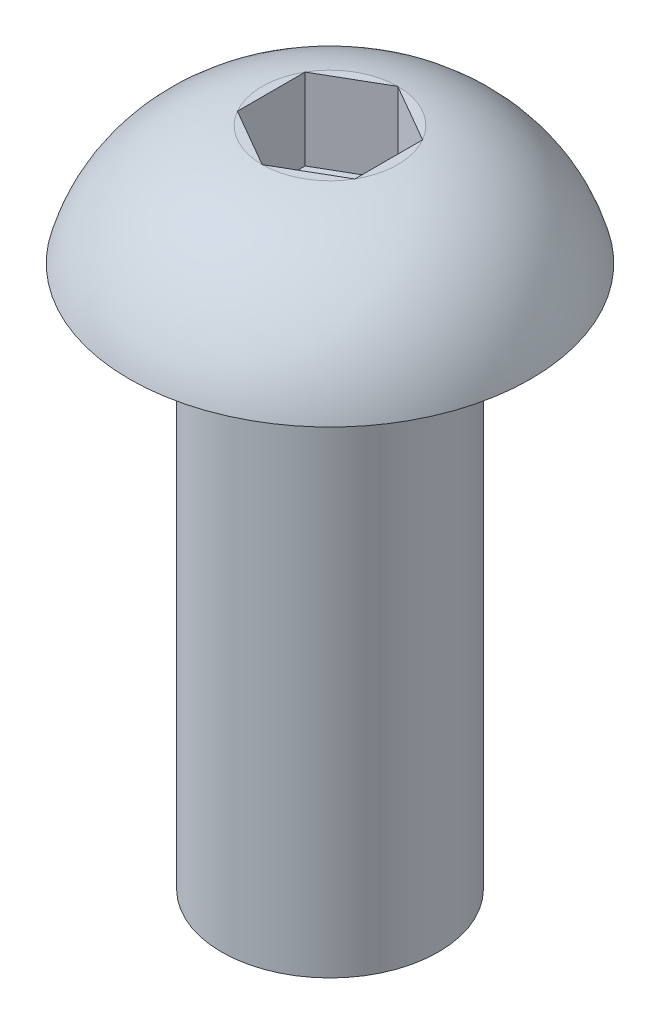
ISO-10303-21;
HEADER;
FILE_DESCRIPTION(('STEP AP214'),'2;1');
FILE_NAME('part.step','',(''),(''),'','','');
FILE_SCHEMA(('AUTOMOTIVE_DESIGN { 1 0 10303 214 1 1 1 1 }'));
ENDSEC;
DATA;
#1=APPLICATION_CONTEXT('core data for automotive mechanical design processes');
#2=APPLICATION_PROTOCOL_DEFINITION('international standard','automotive_design',2000,#1);
#3=PRODUCT_CONTEXT('',#1,'mechanical');
#4=PRODUCT('Part','Part','',(#3));
#5=PRODUCT_RELATED_PRODUCT_CATEGORY('part','',(#4));
#6=PRODUCT_DEFINITION_FORMATION('','',#4);
#7=PRODUCT_DEFINITION_CONTEXT('part definition',#1,'design');
#8=PRODUCT_DEFINITION('design','',#6,#7);
#9=PRODUCT_DEFINITION_SHAPE('','',#8);
#10=(LENGTH_UNIT() NAMED_UNIT(*) SI_UNIT(.MILLI.,.METRE.));
#11=(NAMED_UNIT(*) PLANE_ANGLE_UNIT() SI_UNIT($,.RADIAN.));
#12=(NAMED_UNIT(*) SI_UNIT($,.STERADIAN.) SOLID_ANGLE_UNIT());
#13=UNCERTAINTY_MEASURE_WITH_UNIT(LENGTH_MEASURE(1.E-05),#10,'distance_accuracy_value','');
#14=(GEOMETRIC_REPRESENTATION_CONTEXT(3) GLOBAL_UNCERTAINTY_ASSIGNED_CONTEXT((#13)) GLOBAL_UNIT_ASSIGNED_CONTEXT((#10,
#11,#12)) REPRESENTATION_CONTEXT('',''));
#15=CARTESIAN_POINT('',(0.,0.,0.));
#16=DIRECTION('',(0.,0.,1.));
#17=DIRECTION('',(1.,0.,0.));
#18=AXIS2_PLACEMENT_3D('',#15,#16,#17);
#19=CARTESIAN_POINT('',(0.,2.2,0.));
#20=DIRECTION('',(0.,1.,0.));
#21=DIRECTION('',(0.,0.,1.));
#22=AXIS2_PLACEMENT_3D('',#19,#20,#21);
#23=PLANE('',#22);
#24=DIRECTION('',(-0.866025403784439,0.,-0.5));
#25=VECTOR('',#24,1.);
#26=CARTESIAN_POINT('',(1.08253175473055,2.2,-0.625000000000001));
#27=LINE('',#26,#25);
#28=CARTESIAN_POINT('',(1.08253175473055,2.2,-0.625000000000001));
#29=VERTEX_POINT('',#28);
#30=CARTESIAN_POINT('',(0.,2.2,-1.25));
#31=VERTEX_POINT('',#30);
#32=EDGE_CURVE('E51',#29,#31,#27,.T.);
#33=ORIENTED_EDGE('',*,*,#32,.F.);
#34=CARTESIAN_POINT('',(0.,2.2,0.));
#35=DIRECTION('',(0.,1.,0.));
#36=DIRECTION('',(0.,0.,1.));
#37=AXIS2_PLACEMENT_3D('',#34,#35,#36);
#38=CIRCLE('',#37,1.25);
#39=EDGE_CURVE('E153',#29,#31,#38,.T.);
#40=ORIENTED_EDGE('',*,*,#39,.T.);
#41=EDGE_LOOP('',(#33,#40));
#42=FACE_BOUND('',#41,.T.);
#43=ADVANCED_FACE('F35',(#42),#23,.T.);
#44=DIRECTION('',(0.,0.,-1.));
#45=VECTOR('',#44,1.);
#46=CARTESIAN_POINT('',(1.08253175473055,2.2,0.625000000000001));
#47=LINE('',#46,#45);
#48=CARTESIAN_POINT('',(1.08253175473055,2.2,0.625000000000001));
#49=VERTEX_POINT('',#48);
#50=EDGE_CURVE('E134',#49,#29,#47,.T.);
#51=ORIENTED_EDGE('',*,*,#50,.F.);
#52=EDGE_CURVE('E148',#49,#29,#38,.T.);
#53=ORIENTED_EDGE('',*,*,#52,.T.);
#54=EDGE_LOOP('',(#51,#53));
#55=FACE_BOUND('',#54,.T.);
#56=ADVANCED_FACE('F176',(#55),#23,.T.);
#57=DIRECTION('',(0.866025403784439,0.,-0.5));
#58=VECTOR('',#57,1.);
#59=CARTESIAN_POINT('',(0.,2.2,1.25));
#60=LINE('',#59,#58);
#61=CARTESIAN_POINT('',(0.,2.2,1.25));
#62=VERTEX_POINT('',#61);
#63=EDGE_CURVE('E132',#62,#49,#60,.T.);
#64=ORIENTED_EDGE('',*,*,#63,.F.);
#65=EDGE_CURVE('E146',#62,#49,#38,.T.);
#66=ORIENTED_EDGE('',*,*,#65,.T.);
#67=EDGE_LOOP('',(#64,#66));
#68=FACE_BOUND('',#67,.T.);
#69=ADVANCED_FACE('F178',(#68),#23,.T.);
#70=DIRECTION('',(0.866025403784439,0.,0.5));
#71=VECTOR('',#70,1.);
#72=CARTESIAN_POINT('',(-1.08253175473055,2.2,0.625000000000001));
#73=LINE('',#72,#71);
#74=CARTESIAN_POINT('',(-1.08253175473055,2.2,0.625000000000001));
#75=VERTEX_POINT('',#74);
#76=EDGE_CURVE('E99',#75,#62,#73,.T.);
#77=ORIENTED_EDGE('',*,*,#76,.F.);
#78=EDGE_CURVE('E145',#75,#62,#38,.T.);
#79=ORIENTED_EDGE('',*,*,#78,.T.);
#80=EDGE_LOOP('',(#77,#79));
#81=FACE_BOUND('',#80,.T.);
#82=ADVANCED_FACE('F180',(#81),#23,.T.);
#83=DIRECTION('',(0.,0.,1.));
#84=VECTOR('',#83,1.);
#85=CARTESIAN_POINT('',(-1.08253175473055,2.2,-0.625));
#86=LINE('',#85,#84);
#87=CARTESIAN_POINT('',(-1.08253175473055,2.2,-0.625));
#88=VERTEX_POINT('',#87);
#89=EDGE_CURVE('E128',#88,#75,#86,.T.);
#90=ORIENTED_EDGE('',*,*,#89,.F.);
#91=EDGE_CURVE('E155',#88,#75,#38,.T.);
#92=ORIENTED_EDGE('',*,*,#91,.T.);
#93=EDGE_LOOP('',(#90,#92));
#94=FACE_BOUND('',#93,.T.);
#95=ADVANCED_FACE('F186',(#94),#23,.T.);
#96=CARTESIAN_POINT('',(0.,0.,0.));
#97=DIRECTION('',(0.,1.,0.));
#98=DIRECTION('',(0.,0.,1.));
#99=AXIS2_PLACEMENT_3D('',#96,#97,#98);
#100=PLANE('',#99);
#101=CARTESIAN_POINT('',(0.,0.,0.));
#102=DIRECTION('',(0.,-1.,0.));
#103=DIRECTION('',(0.,0.,-1.));
#104=AXIS2_PLACEMENT_3D('',#101,#102,#103);
#105=CIRCLE('',#104,2.);
#106=CARTESIAN_POINT('',(0.,0.,-2.));
#107=VERTEX_POINT('',#106);
#108=EDGE_CURVE('E11',#107,#107,#105,.T.);
#109=ORIENTED_EDGE('',*,*,#108,.F.);
#110=EDGE_LOOP('',(#109));
#111=FACE_BOUND('',#110,.T.);
#112=CARTESIAN_POINT('',(0.,0.,0.));
#113=DIRECTION('',(0.,1.,0.));
#114=DIRECTION('',(0.,0.,1.));
#115=AXIS2_PLACEMENT_3D('',#112,#113,#114);
#116=CIRCLE('',#115,3.7);
#117=CARTESIAN_POINT('',(0.,0.,3.7));
#118=VERTEX_POINT('',#117);
#119=EDGE_CURVE('E39',#118,#118,#116,.T.);
#120=ORIENTED_EDGE('',*,*,#119,.F.);
#121=EDGE_LOOP('',(#120));
#122=FACE_BOUND('',#121,.T.);
#123=ADVANCED_FACE('F37',(#111,#122),#100,.F.);
#124=CARTESIAN_POINT('',(0.,-0.765971962852529,0.));
#125=DIRECTION('',(0.,1.,0.));
#126=DIRECTION('',(0.,0.,1.));
#127=AXIS2_PLACEMENT_3D('',#124,#125,#126);
#128=DEGENERATE_TOROIDAL_SURFACE('',#127,0.799433339479361,3.,.T.);
#129=ORIENTED_EDGE('',*,*,#65,.F.);
#130=ORIENTED_EDGE('',*,*,#78,.F.);
#131=ORIENTED_EDGE('',*,*,#91,.F.);
#132=EDGE_CURVE('E159',#31,#88,#38,.T.);
#133=ORIENTED_EDGE('',*,*,#132,.F.);
#134=ORIENTED_EDGE('',*,*,#39,.F.);
#135=ORIENTED_EDGE('',*,*,#52,.F.);
#136=EDGE_LOOP('',(#129,#130,#131,#133,#134,#135));
#137=FACE_BOUND('',#136,.T.);
#138=ORIENTED_EDGE('',*,*,#119,.T.);
#139=EDGE_LOOP('',(#138));
#140=FACE_BOUND('',#139,.T.);
#141=ADVANCED_FACE('F172',(#137,#140),#128,.T.);
#142=DIRECTION('',(-0.866025403784439,0.,0.5));
#143=VECTOR('',#142,1.);
#144=CARTESIAN_POINT('',(0.,2.2,-1.25));
#145=LINE('',#144,#143);
#146=EDGE_CURVE('E125',#31,#88,#145,.T.);
#147=ORIENTED_EDGE('',*,*,#146,.F.);
#148=ORIENTED_EDGE('',*,*,#132,.T.);
#149=EDGE_LOOP('',(#147,#148));
#150=FACE_BOUND('',#149,.T.);
#151=ADVANCED_FACE('F187',(#150),#23,.T.);
#152=CARTESIAN_POINT('',(0.,-10.,0.));
#153=DIRECTION('',(0.,1.,0.));
#154=DIRECTION('',(0.,0.,1.));
#155=AXIS2_PLACEMENT_3D('',#152,#153,#154);
#156=CYLINDRICAL_SURFACE('',#155,2.);
#157=CARTESIAN_POINT('',(0.,-10.,0.));
#158=DIRECTION('',(0.,-1.,0.));
#159=DIRECTION('',(0.,0.,-1.));
#160=AXIS2_PLACEMENT_3D('',#157,#158,#159);
#161=CIRCLE('',#160,2.);
#162=CARTESIAN_POINT('',(0.,-10.,-2.));
#163=VERTEX_POINT('',#162);
#164=EDGE_CURVE('E138',#163,#163,#161,.T.);
#165=ORIENTED_EDGE('',*,*,#164,.F.);
#166=EDGE_LOOP('',(#165));
#167=FACE_BOUND('',#166,.T.);
#168=ORIENTED_EDGE('',*,*,#108,.T.);
#169=EDGE_LOOP('',(#168));
#170=FACE_BOUND('',#169,.T.);
#171=ADVANCED_FACE('F193',(#167,#170),#156,.T.);
#172=CARTESIAN_POINT('',(0.,-10.,0.));
#173=DIRECTION('',(0.,-1.,0.));
#174=DIRECTION('',(0.,0.,-1.));
#175=AXIS2_PLACEMENT_3D('',#172,#173,#174);
#176=PLANE('',#175);
#177=ORIENTED_EDGE('',*,*,#164,.T.);
#178=EDGE_LOOP('',(#177));
#179=FACE_BOUND('',#178,.T.);
#180=ADVANCED_FACE('F198',(#179),#176,.T.);
#181=CARTESIAN_POINT('',(1.08253175473055,0.7,-0.625000000000001));
#182=DIRECTION('',(0.5,0.,-0.866025403784439));
#183=DIRECTION('',(-0.866025403784439,0.,-0.5));
#184=AXIS2_PLACEMENT_3D('',#181,#182,#183);
#185=PLANE('',#184);
#186=ORIENTED_EDGE('',*,*,#32,.T.);
#187=DIRECTION('',(0.,1.,0.));
#188=VECTOR('',#187,1.);
#189=CARTESIAN_POINT('',(0.,0.7,-1.25));
#190=LINE('',#189,#188);
#191=CARTESIAN_POINT('',(0.,0.7,-1.25));
#192=VERTEX_POINT('',#191);
#193=EDGE_CURVE('E81',#192,#31,#190,.T.);
#194=ORIENTED_EDGE('',*,*,#193,.F.);
#195=DIRECTION('',(-0.866025403784439,0.,-0.5));
#196=VECTOR('',#195,1.);
#197=CARTESIAN_POINT('',(1.08253175473055,0.7,-0.625000000000001));
#198=LINE('',#197,#196);
#199=CARTESIAN_POINT('',(1.08253175473055,0.7,-0.625000000000001));
#200=VERTEX_POINT('',#199);
#201=EDGE_CURVE('E136',#200,#192,#198,.T.);
#202=ORIENTED_EDGE('',*,*,#201,.F.);
#203=DIRECTION('',(0.,1.,0.));
#204=VECTOR('',#203,1.);
#205=CARTESIAN_POINT('',(1.08253175473055,0.7,-0.625000000000001));
#206=LINE('',#205,#204);
#207=EDGE_CURVE('E59',#200,#29,#206,.T.);
#208=ORIENTED_EDGE('',*,*,#207,.T.);
#209=EDGE_LOOP('',(#186,#194,#202,#208));
#210=FACE_BOUND('',#209,.T.);
#211=ADVANCED_FACE('F210',(#210),#185,.F.);
#212=CARTESIAN_POINT('',(1.08253175473055,0.7,0.625000000000001));
#213=DIRECTION('',(1.,0.,0.));
#214=DIRECTION('',(0.,0.,-1.));
#215=AXIS2_PLACEMENT_3D('',#212,#213,#214);
#216=PLANE('',#215);
#217=ORIENTED_EDGE('',*,*,#50,.T.);
#218=ORIENTED_EDGE('',*,*,#207,.F.);
#219=DIRECTION('',(0.,0.,-1.));
#220=VECTOR('',#219,1.);
#221=CARTESIAN_POINT('',(1.08253175473055,0.7,0.625000000000001));
#222=LINE('',#221,#220);
#223=CARTESIAN_POINT('',(1.08253175473055,0.7,0.625000000000001));
#224=VERTEX_POINT('',#223);
#225=EDGE_CURVE('E111',#224,#200,#222,.T.);
#226=ORIENTED_EDGE('',*,*,#225,.F.);
#227=DIRECTION('',(0.,1.,0.));
#228=VECTOR('',#227,1.);
#229=CARTESIAN_POINT('',(1.08253175473055,0.7,0.625000000000001));
#230=LINE('',#229,#228);
#231=EDGE_CURVE('E103',#224,#49,#230,.T.);
#232=ORIENTED_EDGE('',*,*,#231,.T.);
#233=EDGE_LOOP('',(#217,#218,#226,#232));
#234=FACE_BOUND('',#233,.T.);
#235=ADVANCED_FACE('F177',(#234),#216,.F.);
#236=CARTESIAN_POINT('',(0.,0.7,1.25));
#237=DIRECTION('',(0.5,0.,0.866025403784439));
#238=DIRECTION('',(0.866025403784439,0.,-0.5));
#239=AXIS2_PLACEMENT_3D('',#236,#237,#238);
#240=PLANE('',#239);
#241=ORIENTED_EDGE('',*,*,#63,.T.);
#242=ORIENTED_EDGE('',*,*,#231,.F.);
#243=DIRECTION('',(0.866025403784439,0.,-0.5));
#244=VECTOR('',#243,1.);
#245=CARTESIAN_POINT('',(0.,0.7,1.25));
#246=LINE('',#245,#244);
#247=CARTESIAN_POINT('',(0.,0.7,1.25));
#248=VERTEX_POINT('',#247);
#249=EDGE_CURVE('E107',#248,#224,#246,.T.);
#250=ORIENTED_EDGE('',*,*,#249,.F.);
#251=DIRECTION('',(0.,1.,0.));
#252=VECTOR('',#251,1.);
#253=CARTESIAN_POINT('',(0.,0.7,1.25));
#254=LINE('',#253,#252);
#255=EDGE_CURVE('E92',#248,#62,#254,.T.);
#256=ORIENTED_EDGE('',*,*,#255,.T.);
#257=EDGE_LOOP('',(#241,#242,#250,#256));
#258=FACE_BOUND('',#257,.T.);
#259=ADVANCED_FACE('F108',(#258),#240,.F.);
#260=CARTESIAN_POINT('',(-1.08253175473055,0.7,0.625000000000001));
#261=DIRECTION('',(-0.5,0.,0.866025403784439));
#262=DIRECTION('',(0.866025403784439,0.,0.5));
#263=AXIS2_PLACEMENT_3D('',#260,#261,#262);
#264=PLANE('',#263);
#265=ORIENTED_EDGE('',*,*,#76,.T.);
#266=ORIENTED_EDGE('',*,*,#255,.F.);
#267=DIRECTION('',(0.866025403784439,0.,0.5));
#268=VECTOR('',#267,1.);
#269=CARTESIAN_POINT('',(-1.08253175473055,0.7,0.625000000000001));
#270=LINE('',#269,#268);
#271=CARTESIAN_POINT('',(-1.08253175473055,0.7,0.625000000000001));
#272=VERTEX_POINT('',#271);
#273=EDGE_CURVE('E96',#272,#248,#270,.T.);
#274=ORIENTED_EDGE('',*,*,#273,.F.);
#275=DIRECTION('',(0.,1.,0.));
#276=VECTOR('',#275,1.);
#277=CARTESIAN_POINT('',(-1.08253175473055,0.7,0.625000000000001));
#278=LINE('',#277,#276);
#279=EDGE_CURVE('E104',#272,#75,#278,.T.);
#280=ORIENTED_EDGE('',*,*,#279,.T.);
#281=EDGE_LOOP('',(#265,#266,#274,#280));
#282=FACE_BOUND('',#281,.T.);
#283=ADVANCED_FACE('F94',(#282),#264,.F.);
#284=CARTESIAN_POINT('',(-1.08253175473055,0.7,-0.625));
#285=DIRECTION('',(-1.,0.,0.));
#286=DIRECTION('',(0.,0.,1.));
#287=AXIS2_PLACEMENT_3D('',#284,#285,#286);
#288=PLANE('',#287);
#289=ORIENTED_EDGE('',*,*,#89,.T.);
#290=ORIENTED_EDGE('',*,*,#279,.F.);
#291=DIRECTION('',(0.,0.,1.));
#292=VECTOR('',#291,1.);
#293=CARTESIAN_POINT('',(-1.08253175473055,0.7,-0.625));
#294=LINE('',#293,#292);
#295=CARTESIAN_POINT('',(-1.08253175473055,0.7,-0.625));
#296=VERTEX_POINT('',#295);
#297=EDGE_CURVE('E117',#296,#272,#294,.T.);
#298=ORIENTED_EDGE('',*,*,#297,.F.);
#299=DIRECTION('',(0.,1.,0.));
#300=VECTOR('',#299,1.);
#301=CARTESIAN_POINT('',(-1.08253175473055,0.7,-0.625));
#302=LINE('',#301,#300);
#303=EDGE_CURVE('E141',#296,#88,#302,.T.);
#304=ORIENTED_EDGE('',*,*,#303,.T.);
#305=EDGE_LOOP('',(#289,#290,#298,#304));
#306=FACE_BOUND('',#305,.T.);
#307=ADVANCED_FACE('F206',(#306),#288,.F.);
#308=CARTESIAN_POINT('',(0.,0.7,-1.25));
#309=DIRECTION('',(-0.5,0.,-0.866025403784438));
#310=DIRECTION('',(-0.866025403784439,0.,0.5));
#311=AXIS2_PLACEMENT_3D('',#308,#309,#310);
#312=PLANE('',#311);
#313=ORIENTED_EDGE('',*,*,#146,.T.);
#314=ORIENTED_EDGE('',*,*,#303,.F.);
#315=DIRECTION('',(-0.866025403784439,0.,0.5));
#316=VECTOR('',#315,1.);
#317=CARTESIAN_POINT('',(0.,0.7,-1.25));
#318=LINE('',#317,#316);
#319=EDGE_CURVE('E119',#192,#296,#318,.T.);
#320=ORIENTED_EDGE('',*,*,#319,.F.);
#321=ORIENTED_EDGE('',*,*,#193,.T.);
#322=EDGE_LOOP('',(#313,#314,#320,#321));
#323=FACE_BOUND('',#322,.T.);
#324=ADVANCED_FACE('F208',(#323),#312,.F.);
#325=CARTESIAN_POINT('',(0.,0.7,0.));
#326=DIRECTION('',(0.,1.,0.));
#327=DIRECTION('',(0.,0.,1.));
#328=AXIS2_PLACEMENT_3D('',#325,#326,#327);
#329=PLANE('',#328);
#330=ORIENTED_EDGE('',*,*,#201,.T.);
#331=ORIENTED_EDGE('',*,*,#319,.T.);
#332=ORIENTED_EDGE('',*,*,#297,.T.);
#333=ORIENTED_EDGE('',*,*,#273,.T.);
#334=ORIENTED_EDGE('',*,*,#249,.T.);
#335=ORIENTED_EDGE('',*,*,#225,.T.);
#336=EDGE_LOOP('',(#330,#331,#332,#333,#334,#335));
#337=FACE_BOUND('',#336,.T.);
#338=ADVANCED_FACE('F114',(#337),#329,.T.);
#339=CLOSED_SHELL('',(#43,#56,#69,#82,#95,#123,#141,#151,#171,#180,#211,#235,#259,#283,#307,
#324,#338));
#340=MANIFOLD_SOLID_BREP('B2',#339);
#341=ADVANCED_BREP_SHAPE_REPRESENTATION('',(#18,#340),#14);
#342=SHAPE_DEFINITION_REPRESENTATION(#9,#341);
ENDSEC;
END-ISO-10303-21;
